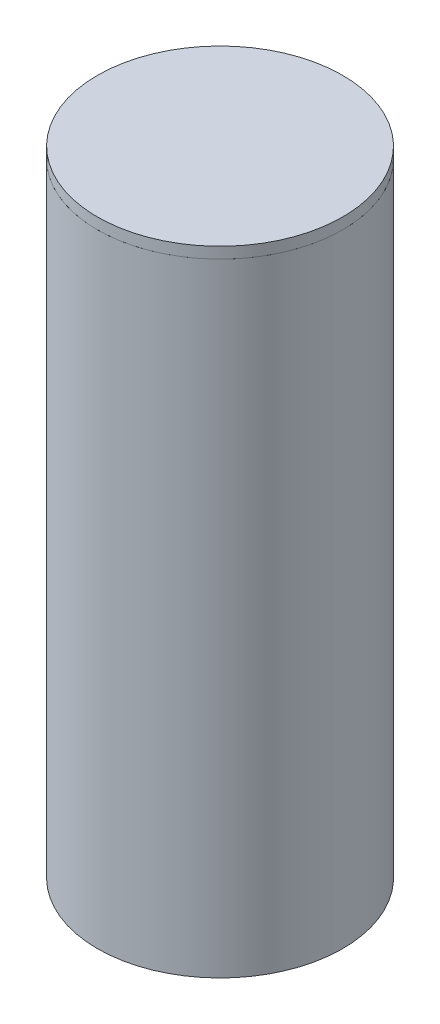
ISO-10303-21;
HEADER;
FILE_DESCRIPTION(('STEP AP214'),'2;1');
FILE_NAME('part.step','',(''),(''),'','','');
FILE_SCHEMA(('AUTOMOTIVE_DESIGN { 1 0 10303 214 1 1 1 1 }'));
ENDSEC;
DATA;
#1=APPLICATION_CONTEXT('core data for automotive mechanical design processes');
#2=APPLICATION_PROTOCOL_DEFINITION('international standard','automotive_design',2000,#1);
#3=PRODUCT_CONTEXT('',#1,'mechanical');
#4=PRODUCT('Part','Part','',(#3));
#5=PRODUCT_RELATED_PRODUCT_CATEGORY('part','',(#4));
#6=PRODUCT_DEFINITION_FORMATION('','',#4);
#7=PRODUCT_DEFINITION_CONTEXT('part definition',#1,'design');
#8=PRODUCT_DEFINITION('design','',#6,#7);
#9=PRODUCT_DEFINITION_SHAPE('','',#8);
#10=(LENGTH_UNIT() NAMED_UNIT(*) SI_UNIT(.MILLI.,.METRE.));
#11=(NAMED_UNIT(*) PLANE_ANGLE_UNIT() SI_UNIT($,.RADIAN.));
#12=(NAMED_UNIT(*) SI_UNIT($,.STERADIAN.) SOLID_ANGLE_UNIT());
#13=UNCERTAINTY_MEASURE_WITH_UNIT(LENGTH_MEASURE(1.E-05),#10,'distance_accuracy_value','');
#14=(GEOMETRIC_REPRESENTATION_CONTEXT(3) GLOBAL_UNCERTAINTY_ASSIGNED_CONTEXT((#13)) GLOBAL_UNIT_ASSIGNED_CONTEXT((#10,
#11,#12)) REPRESENTATION_CONTEXT('',''));
#15=CARTESIAN_POINT('',(0.,0.,0.));
#16=DIRECTION('',(0.,0.,1.));
#17=DIRECTION('',(1.,0.,0.));
#18=AXIS2_PLACEMENT_3D('',#15,#16,#17);
#19=CARTESIAN_POINT('',(52.3389067661735,161.731450663873,141.18018803191));
#20=DIRECTION('',(0.,1.,0.));
#21=DIRECTION('',(0.838860430837608,0.,-0.54434656017554));
#22=AXIS2_PLACEMENT_3D('',#19,#20,#21);
#23=CYLINDRICAL_SURFACE('',#22,33.1);
#24=CARTESIAN_POINT('',(52.3389067661735,161.731450663873,141.18018803191));
#25=DIRECTION('',(0.,-1.,0.));
#26=DIRECTION('',(-0.838860430837608,0.,0.54434656017554));
#27=AXIS2_PLACEMENT_3D('',#24,#25,#26);
#28=CIRCLE('',#27,33.1);
#29=CARTESIAN_POINT('',(24.5726265054487,161.731450663873,159.19805917372));
#30=VERTEX_POINT('',#29);
#31=EDGE_CURVE('P0_E21',#30,#30,#28,.T.);
#32=ORIENTED_EDGE('',*,*,#31,.F.);
#33=EDGE_LOOP('',(#32));
#34=FACE_BOUND('',#33,.T.);
#35=CARTESIAN_POINT('',(52.3389067661735,164.731450663873,141.18018803191));
#36=DIRECTION('',(0.,-1.,0.));
#37=DIRECTION('',(-0.838860430837608,0.,0.54434656017554));
#38=AXIS2_PLACEMENT_3D('',#35,#36,#37);
#39=CIRCLE('',#38,33.1);
#40=CARTESIAN_POINT('',(24.5726265054487,164.731450663873,159.19805917372));
#41=VERTEX_POINT('',#40);
#42=EDGE_CURVE('P0_E17',#41,#41,#39,.T.);
#43=ORIENTED_EDGE('',*,*,#42,.T.);
#44=EDGE_LOOP('',(#43));
#45=FACE_BOUND('',#44,.T.);
#46=ADVANCED_FACE('P0_F14',(#34,#45),#23,.T.);
#47=CARTESIAN_POINT('',(52.3389067661735,161.731450663873,141.18018803191));
#48=DIRECTION('',(0.,-1.,0.));
#49=DIRECTION('',(-0.838860430837608,0.,0.54434656017554));
#50=AXIS2_PLACEMENT_3D('',#47,#48,#49);
#51=PLANE('',#50);
#52=CARTESIAN_POINT('',(52.3389067661735,161.731450663873,141.18018803191));
#53=DIRECTION('',(0.,-1.,0.));
#54=DIRECTION('',(-0.838860430837608,0.,0.54434656017554));
#55=AXIS2_PLACEMENT_3D('',#52,#53,#54);
#56=CIRCLE('',#55,30.9);
#57=CARTESIAN_POINT('',(26.4181194532914,161.731450663873,158.000496741334));
#58=VERTEX_POINT('',#57);
#59=EDGE_CURVE('P0_E9',#58,#58,#56,.T.);
#60=ORIENTED_EDGE('',*,*,#59,.F.);
#61=EDGE_LOOP('',(#60));
#62=FACE_BOUND('',#61,.T.);
#63=ORIENTED_EDGE('',*,*,#31,.T.);
#64=EDGE_LOOP('',(#63));
#65=FACE_BOUND('',#64,.T.);
#66=ADVANCED_FACE('P0_F38',(#62,#65),#51,.T.);
#67=CARTESIAN_POINT('',(52.3389067661735,164.731450663873,141.18018803191));
#68=DIRECTION('',(0.,-1.,0.));
#69=DIRECTION('',(-0.838860430837608,0.,0.54434656017554));
#70=AXIS2_PLACEMENT_3D('',#67,#68,#69);
#71=PLANE('',#70);
#72=ORIENTED_EDGE('',*,*,#42,.F.);
#73=EDGE_LOOP('',(#72));
#74=FACE_BOUND('',#73,.T.);
#75=ADVANCED_FACE('P0_F35',(#74),#71,.F.);
#76=CARTESIAN_POINT('',(52.3389067661735,156.731450663873,141.18018803191));
#77=DIRECTION('',(0.,1.,0.));
#78=DIRECTION('',(0.838860430837608,0.,-0.54434656017554));
#79=AXIS2_PLACEMENT_3D('',#76,#77,#78);
#80=CYLINDRICAL_SURFACE('',#79,30.9);
#81=CARTESIAN_POINT('',(52.3389067661735,156.731450663873,141.18018803191));
#82=DIRECTION('',(0.,-1.,0.));
#83=DIRECTION('',(-0.838860430837608,0.,0.54434656017554));
#84=AXIS2_PLACEMENT_3D('',#81,#82,#83);
#85=CIRCLE('',#84,30.9);
#86=CARTESIAN_POINT('',(26.4181194532914,156.731450663873,158.000496741334));
#87=VERTEX_POINT('',#86);
#88=EDGE_CURVE('P0_E27',#87,#87,#85,.T.);
#89=ORIENTED_EDGE('',*,*,#88,.F.);
#90=EDGE_LOOP('',(#89));
#91=FACE_BOUND('',#90,.T.);
#92=ORIENTED_EDGE('',*,*,#59,.T.);
#93=EDGE_LOOP('',(#92));
#94=FACE_BOUND('',#93,.T.);
#95=ADVANCED_FACE('P0_F37',(#91,#94),#80,.T.);
#96=CARTESIAN_POINT('',(52.3389067661735,156.731450663873,141.18018803191));
#97=DIRECTION('',(0.,-1.,0.));
#98=DIRECTION('',(-0.838860430837608,0.,0.54434656017554));
#99=AXIS2_PLACEMENT_3D('',#96,#97,#98);
#100=PLANE('',#99);
#101=ORIENTED_EDGE('',*,*,#88,.T.);
#102=EDGE_LOOP('',(#101));
#103=FACE_BOUND('',#102,.T.);
#104=ADVANCED_FACE('P0_F44',(#103),#100,.T.);
#105=CLOSED_SHELL('',(#46,#66,#75,#95,#104));
#106=MANIFOLD_SOLID_BREP('P0_B1',#105);
#107=CARTESIAN_POINT('',(52.3389067661735,161.731450663873,141.18018803191));
#108=DIRECTION('',(0.,-1.,0.));
#109=DIRECTION('',(0.,0.,-1.));
#110=AXIS2_PLACEMENT_3D('',#107,#108,#109);
#111=CYLINDRICAL_SURFACE('',#110,31.1);
#112=CARTESIAN_POINT('',(52.3389067661735,161.731450663873,141.18018803191));
#113=DIRECTION('',(0.,1.,0.));
#114=DIRECTION('',(0.,0.,1.));
#115=AXIS2_PLACEMENT_3D('',#112,#113,#114);
#116=CIRCLE('',#115,31.1);
#117=CARTESIAN_POINT('',(52.3389067661735,161.731450663873,172.28018803191));
#118=VERTEX_POINT('',#117);
#119=EDGE_CURVE('P1_E31',#118,#118,#116,.T.);
#120=ORIENTED_EDGE('',*,*,#119,.T.);
#121=EDGE_LOOP('',(#120));
#122=FACE_BOUND('',#121,.T.);
#123=CARTESIAN_POINT('',(52.3389067661735,-4.26854933612678,141.18018803191));
#124=DIRECTION('',(0.,1.,0.));
#125=DIRECTION('',(0.,0.,1.));
#126=AXIS2_PLACEMENT_3D('',#123,#124,#125);
#127=CIRCLE('',#126,31.1);
#128=CARTESIAN_POINT('',(52.3389067661735,-4.26854933612678,172.28018803191));
#129=VERTEX_POINT('',#128);
#130=EDGE_CURVE('P1_E10',#129,#129,#127,.T.);
#131=ORIENTED_EDGE('',*,*,#130,.F.);
#132=EDGE_LOOP('',(#131));
#133=FACE_BOUND('',#132,.T.);
#134=ADVANCED_FACE('P1_F15',(#122,#133),#111,.F.);
#135=CARTESIAN_POINT('',(52.3389067661735,-4.26854933612678,141.18018803191));
#136=DIRECTION('',(0.,1.,0.));
#137=DIRECTION('',(0.,0.,1.));
#138=AXIS2_PLACEMENT_3D('',#135,#136,#137);
#139=PLANE('',#138);
#140=ORIENTED_EDGE('',*,*,#130,.T.);
#141=EDGE_LOOP('',(#140));
#142=FACE_BOUND('',#141,.T.);
#143=ADVANCED_FACE('P1_F17',(#142),#139,.T.);
#144=CARTESIAN_POINT('',(52.3389067661735,161.731450663873,141.18018803191));
#145=DIRECTION('',(0.,-1.,0.));
#146=DIRECTION('',(0.,0.,-1.));
#147=AXIS2_PLACEMENT_3D('',#144,#145,#146);
#148=CYLINDRICAL_SURFACE('',#147,33.1);
#149=CARTESIAN_POINT('',(52.3389067661735,161.731450663873,141.18018803191));
#150=DIRECTION('',(0.,1.,0.));
#151=DIRECTION('',(0.,0.,1.));
#152=AXIS2_PLACEMENT_3D('',#149,#150,#151);
#153=CIRCLE('',#152,33.1);
#154=CARTESIAN_POINT('',(52.3389067661735,161.731450663873,174.28018803191));
#155=VERTEX_POINT('',#154);
#156=EDGE_CURVE('P1_E22',#155,#155,#153,.T.);
#157=ORIENTED_EDGE('',*,*,#156,.F.);
#158=EDGE_LOOP('',(#157));
#159=FACE_BOUND('',#158,.T.);
#160=CARTESIAN_POINT('',(52.3389067661735,-6.26854933612678,141.18018803191));
#161=DIRECTION('',(0.,1.,0.));
#162=DIRECTION('',(0.,0.,1.));
#163=AXIS2_PLACEMENT_3D('',#160,#161,#162);
#164=CIRCLE('',#163,33.1);
#165=CARTESIAN_POINT('',(52.3389067661735,-6.26854933612678,174.28018803191));
#166=VERTEX_POINT('',#165);
#167=EDGE_CURVE('P1_E26',#166,#166,#164,.T.);
#168=ORIENTED_EDGE('',*,*,#167,.T.);
#169=EDGE_LOOP('',(#168));
#170=FACE_BOUND('',#169,.T.);
#171=ADVANCED_FACE('P1_F41',(#159,#170),#148,.T.);
#172=CARTESIAN_POINT('',(52.3389067661735,161.731450663873,141.18018803191));
#173=DIRECTION('',(0.,1.,0.));
#174=DIRECTION('',(0.,0.,1.));
#175=AXIS2_PLACEMENT_3D('',#172,#173,#174);
#176=PLANE('',#175);
#177=ORIENTED_EDGE('',*,*,#119,.F.);
#178=EDGE_LOOP('',(#177));
#179=FACE_BOUND('',#178,.T.);
#180=ORIENTED_EDGE('',*,*,#156,.T.);
#181=EDGE_LOOP('',(#180));
#182=FACE_BOUND('',#181,.T.);
#183=ADVANCED_FACE('P1_F38',(#179,#182),#176,.T.);
#184=CARTESIAN_POINT('',(52.3389067661735,-6.26854933612678,141.18018803191));
#185=DIRECTION('',(0.,1.,0.));
#186=DIRECTION('',(0.,0.,1.));
#187=AXIS2_PLACEMENT_3D('',#184,#185,#186);
#188=PLANE('',#187);
#189=ORIENTED_EDGE('',*,*,#167,.F.);
#190=EDGE_LOOP('',(#189));
#191=FACE_BOUND('',#190,.T.);
#192=ADVANCED_FACE('P1_F40',(#191),#188,.F.);
#193=CLOSED_SHELL('',(#134,#143,#171,#183,#192));
#194=MANIFOLD_SOLID_BREP('P1_B1',#193);
#195=ADVANCED_BREP_SHAPE_REPRESENTATION('',(#18,#106,#194),#14);
#196=SHAPE_DEFINITION_REPRESENTATION(#9,#195);
ENDSEC;
END-ISO-10303-21;
